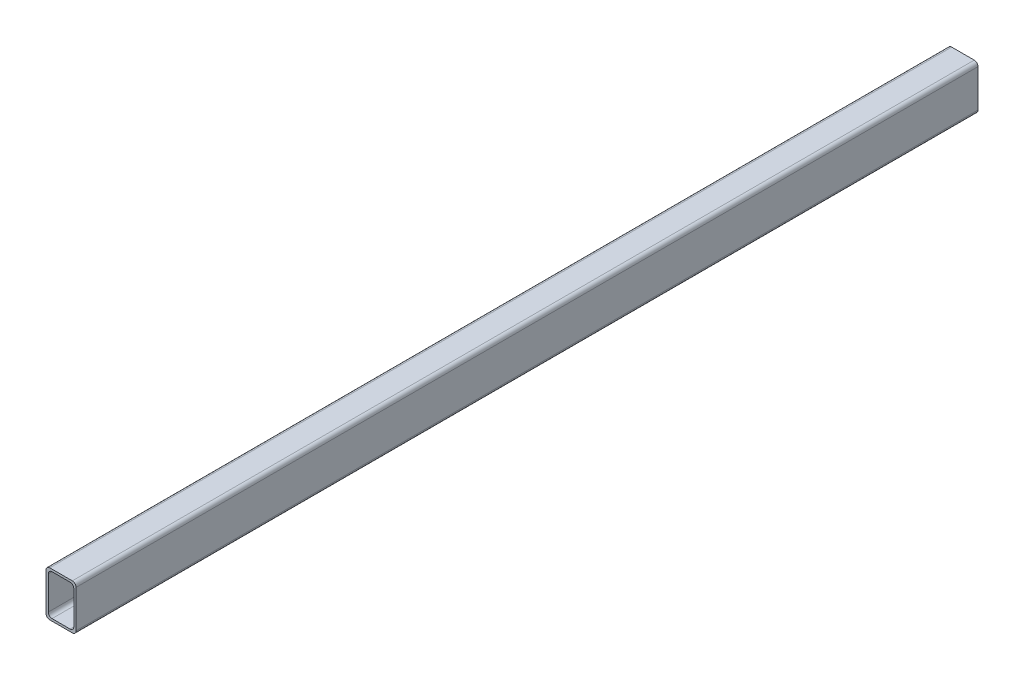
ISO-10303-21;
HEADER;
FILE_DESCRIPTION(('STEP AP214'),'2;1');
FILE_NAME('part.step','',(''),(''),'','','');
FILE_SCHEMA(('AUTOMOTIVE_DESIGN { 1 0 10303 214 1 1 1 1 }'));
ENDSEC;
DATA;
#1=APPLICATION_CONTEXT('core data for automotive mechanical design processes');
#2=APPLICATION_PROTOCOL_DEFINITION('international standard','automotive_design',2000,#1);
#3=PRODUCT_CONTEXT('',#1,'mechanical');
#4=PRODUCT('Part','Part','',(#3));
#5=PRODUCT_RELATED_PRODUCT_CATEGORY('part','',(#4));
#6=PRODUCT_DEFINITION_FORMATION('','',#4);
#7=PRODUCT_DEFINITION_CONTEXT('part definition',#1,'design');
#8=PRODUCT_DEFINITION('design','',#6,#7);
#9=PRODUCT_DEFINITION_SHAPE('','',#8);
#10=(LENGTH_UNIT() NAMED_UNIT(*) SI_UNIT(.MILLI.,.METRE.));
#11=(NAMED_UNIT(*) PLANE_ANGLE_UNIT() SI_UNIT($,.RADIAN.));
#12=(NAMED_UNIT(*) SI_UNIT($,.STERADIAN.) SOLID_ANGLE_UNIT());
#13=UNCERTAINTY_MEASURE_WITH_UNIT(LENGTH_MEASURE(1.E-05),#10,'distance_accuracy_value','');
#14=(GEOMETRIC_REPRESENTATION_CONTEXT(3) GLOBAL_UNCERTAINTY_ASSIGNED_CONTEXT((#13)) GLOBAL_UNIT_ASSIGNED_CONTEXT((#10,
#11,#12)) REPRESENTATION_CONTEXT('',''));
#15=CARTESIAN_POINT('',(0.,0.,0.));
#16=DIRECTION('',(0.,0.,1.));
#17=DIRECTION('',(1.,0.,0.));
#18=AXIS2_PLACEMENT_3D('',#15,#16,#17);
#19=CARTESIAN_POINT('',(-15.,-25.,1200.));
#20=DIRECTION('',(0.,0.,-1.));
#21=DIRECTION('',(-1.,0.,0.));
#22=AXIS2_PLACEMENT_3D('',#19,#20,#21);
#23=PLANE('',#22);
#24=CARTESIAN_POINT('',(-15.,-25.,1200.));
#25=DIRECTION('',(0.,0.,1.));
#26=DIRECTION('',(-1.,0.,0.));
#27=AXIS2_PLACEMENT_3D('',#24,#25,#26);
#28=CIRCLE('',#27,5.);
#29=CARTESIAN_POINT('',(-20.,-25.,1200.));
#30=VERTEX_POINT('',#29);
#31=CARTESIAN_POINT('',(-15.,-30.,1200.));
#32=VERTEX_POINT('',#31);
#33=EDGE_CURVE('E242',#30,#32,#28,.T.);
#34=ORIENTED_EDGE('',*,*,#33,.T.);
#35=DIRECTION('',(1.,0.,0.));
#36=VECTOR('',#35,1.);
#37=CARTESIAN_POINT('',(-15.,-30.,1200.));
#38=LINE('',#37,#36);
#39=CARTESIAN_POINT('',(15.,-30.,1200.));
#40=VERTEX_POINT('',#39);
#41=EDGE_CURVE('E246',#32,#40,#38,.T.);
#42=ORIENTED_EDGE('',*,*,#41,.T.);
#43=CARTESIAN_POINT('',(15.,-25.,1200.));
#44=DIRECTION('',(0.,0.,1.));
#45=DIRECTION('',(1.,0.,0.));
#46=AXIS2_PLACEMENT_3D('',#43,#44,#45);
#47=CIRCLE('',#46,5.);
#48=CARTESIAN_POINT('',(20.,-25.,1200.));
#49=VERTEX_POINT('',#48);
#50=EDGE_CURVE('E250',#40,#49,#47,.T.);
#51=ORIENTED_EDGE('',*,*,#50,.T.);
#52=DIRECTION('',(0.,1.,0.));
#53=VECTOR('',#52,1.);
#54=CARTESIAN_POINT('',(20.,-25.,1200.));
#55=LINE('',#54,#53);
#56=CARTESIAN_POINT('',(20.,25.,1200.));
#57=VERTEX_POINT('',#56);
#58=EDGE_CURVE('E253',#49,#57,#55,.T.);
#59=ORIENTED_EDGE('',*,*,#58,.T.);
#60=CARTESIAN_POINT('',(15.,25.,1200.));
#61=DIRECTION('',(0.,0.,1.));
#62=DIRECTION('',(-1.,0.,0.));
#63=AXIS2_PLACEMENT_3D('',#60,#61,#62);
#64=CIRCLE('',#63,5.);
#65=CARTESIAN_POINT('',(15.,30.,1200.));
#66=VERTEX_POINT('',#65);
#67=EDGE_CURVE('E256',#57,#66,#64,.T.);
#68=ORIENTED_EDGE('',*,*,#67,.T.);
#69=DIRECTION('',(-1.,0.,0.));
#70=VECTOR('',#69,1.);
#71=CARTESIAN_POINT('',(-15.,30.,1200.));
#72=LINE('',#71,#70);
#73=CARTESIAN_POINT('',(-15.,30.,1200.));
#74=VERTEX_POINT('',#73);
#75=EDGE_CURVE('E259',#66,#74,#72,.T.);
#76=ORIENTED_EDGE('',*,*,#75,.T.);
#77=CARTESIAN_POINT('',(-15.,25.,1200.));
#78=DIRECTION('',(0.,0.,1.));
#79=DIRECTION('',(-1.,0.,0.));
#80=AXIS2_PLACEMENT_3D('',#77,#78,#79);
#81=CIRCLE('',#80,5.);
#82=CARTESIAN_POINT('',(-20.,25.,1200.));
#83=VERTEX_POINT('',#82);
#84=EDGE_CURVE('E262',#74,#83,#81,.T.);
#85=ORIENTED_EDGE('',*,*,#84,.T.);
#86=DIRECTION('',(0.,-1.,0.));
#87=VECTOR('',#86,1.);
#88=CARTESIAN_POINT('',(-20.,-25.,1200.));
#89=LINE('',#88,#87);
#90=EDGE_CURVE('E265',#83,#30,#89,.T.);
#91=ORIENTED_EDGE('',*,*,#90,.T.);
#92=EDGE_LOOP('',(#34,#42,#51,#59,#68,#76,#85,#91));
#93=FACE_BOUND('',#92,.T.);
#94=CARTESIAN_POINT('',(12.,22.,1200.));
#95=DIRECTION('',(0.,0.,1.));
#96=DIRECTION('',(-1.,0.,0.));
#97=AXIS2_PLACEMENT_3D('',#94,#95,#96);
#98=CIRCLE('',#97,5.);
#99=CARTESIAN_POINT('',(17.,22.,1200.));
#100=VERTEX_POINT('',#99);
#101=CARTESIAN_POINT('',(12.,27.,1200.));
#102=VERTEX_POINT('',#101);
#103=EDGE_CURVE('E153',#100,#102,#98,.T.);
#104=ORIENTED_EDGE('',*,*,#103,.F.);
#105=DIRECTION('',(0.,1.,0.));
#106=VECTOR('',#105,1.);
#107=CARTESIAN_POINT('',(17.,-22.,1200.));
#108=LINE('',#107,#106);
#109=CARTESIAN_POINT('',(17.,-22.,1200.));
#110=VERTEX_POINT('',#109);
#111=EDGE_CURVE('E194',#110,#100,#108,.T.);
#112=ORIENTED_EDGE('',*,*,#111,.F.);
#113=CARTESIAN_POINT('',(12.,-22.,1200.));
#114=DIRECTION('',(0.,0.,1.));
#115=DIRECTION('',(1.,0.,0.));
#116=AXIS2_PLACEMENT_3D('',#113,#114,#115);
#117=CIRCLE('',#116,5.);
#118=CARTESIAN_POINT('',(12.,-27.,1200.));
#119=VERTEX_POINT('',#118);
#120=EDGE_CURVE('E191',#119,#110,#117,.T.);
#121=ORIENTED_EDGE('',*,*,#120,.F.);
#122=DIRECTION('',(1.,0.,0.));
#123=VECTOR('',#122,1.);
#124=CARTESIAN_POINT('',(-12.,-27.,1200.));
#125=LINE('',#124,#123);
#126=CARTESIAN_POINT('',(-12.,-27.,1200.));
#127=VERTEX_POINT('',#126);
#128=EDGE_CURVE('E188',#127,#119,#125,.T.);
#129=ORIENTED_EDGE('',*,*,#128,.F.);
#130=CARTESIAN_POINT('',(-12.,-22.,1200.));
#131=DIRECTION('',(0.,0.,1.));
#132=DIRECTION('',(-1.,0.,0.));
#133=AXIS2_PLACEMENT_3D('',#130,#131,#132);
#134=CIRCLE('',#133,5.);
#135=CARTESIAN_POINT('',(-17.,-22.,1200.));
#136=VERTEX_POINT('',#135);
#137=EDGE_CURVE('E185',#136,#127,#134,.T.);
#138=ORIENTED_EDGE('',*,*,#137,.F.);
#139=DIRECTION('',(0.,-1.,0.));
#140=VECTOR('',#139,1.);
#141=CARTESIAN_POINT('',(-17.,-22.,1200.));
#142=LINE('',#141,#140);
#143=CARTESIAN_POINT('',(-17.,22.,1200.));
#144=VERTEX_POINT('',#143);
#145=EDGE_CURVE('E180',#144,#136,#142,.T.);
#146=ORIENTED_EDGE('',*,*,#145,.F.);
#147=CARTESIAN_POINT('',(-12.,22.,1200.));
#148=DIRECTION('',(0.,0.,1.));
#149=DIRECTION('',(-1.,0.,0.));
#150=AXIS2_PLACEMENT_3D('',#147,#148,#149);
#151=CIRCLE('',#150,5.);
#152=CARTESIAN_POINT('',(-12.,27.,1200.));
#153=VERTEX_POINT('',#152);
#154=EDGE_CURVE('E176',#153,#144,#151,.T.);
#155=ORIENTED_EDGE('',*,*,#154,.F.);
#156=DIRECTION('',(-1.,0.,0.));
#157=VECTOR('',#156,1.);
#158=CARTESIAN_POINT('',(-12.,27.,1200.));
#159=LINE('',#158,#157);
#160=EDGE_CURVE('E162',#102,#153,#159,.T.);
#161=ORIENTED_EDGE('',*,*,#160,.F.);
#162=EDGE_LOOP('',(#104,#112,#121,#129,#138,#146,#155,#161));
#163=FACE_BOUND('',#162,.T.);
#164=ADVANCED_FACE('F39',(#93,#163),#23,.F.);
#165=CARTESIAN_POINT('',(-15.,-25.,0.));
#166=DIRECTION('',(0.,0.,-1.));
#167=DIRECTION('',(-1.,0.,0.));
#168=AXIS2_PLACEMENT_3D('',#165,#166,#167);
#169=PLANE('',#168);
#170=CARTESIAN_POINT('',(-15.,-25.,0.));
#171=DIRECTION('',(0.,0.,1.));
#172=DIRECTION('',(-1.,0.,0.));
#173=AXIS2_PLACEMENT_3D('',#170,#171,#172);
#174=CIRCLE('',#173,5.);
#175=CARTESIAN_POINT('',(-20.,-25.,0.));
#176=VERTEX_POINT('',#175);
#177=CARTESIAN_POINT('',(-15.,-30.,0.));
#178=VERTEX_POINT('',#177);
#179=EDGE_CURVE('E171',#176,#178,#174,.T.);
#180=ORIENTED_EDGE('',*,*,#179,.F.);
#181=DIRECTION('',(0.,-1.,0.));
#182=VECTOR('',#181,1.);
#183=CARTESIAN_POINT('',(-20.,-25.,0.));
#184=LINE('',#183,#182);
#185=CARTESIAN_POINT('',(-20.,25.,0.));
#186=VERTEX_POINT('',#185);
#187=EDGE_CURVE('E247',#186,#176,#184,.T.);
#188=ORIENTED_EDGE('',*,*,#187,.F.);
#189=CARTESIAN_POINT('',(-15.,25.,0.));
#190=DIRECTION('',(0.,0.,1.));
#191=DIRECTION('',(-1.,0.,0.));
#192=AXIS2_PLACEMENT_3D('',#189,#190,#191);
#193=CIRCLE('',#192,5.);
#194=CARTESIAN_POINT('',(-15.,30.,0.));
#195=VERTEX_POINT('',#194);
#196=EDGE_CURVE('E287',#195,#186,#193,.T.);
#197=ORIENTED_EDGE('',*,*,#196,.F.);
#198=DIRECTION('',(-1.,0.,0.));
#199=VECTOR('',#198,1.);
#200=CARTESIAN_POINT('',(-15.,30.,0.));
#201=LINE('',#200,#199);
#202=CARTESIAN_POINT('',(15.,30.,0.));
#203=VERTEX_POINT('',#202);
#204=EDGE_CURVE('E284',#203,#195,#201,.T.);
#205=ORIENTED_EDGE('',*,*,#204,.F.);
#206=CARTESIAN_POINT('',(15.,25.,0.));
#207=DIRECTION('',(0.,0.,1.));
#208=DIRECTION('',(-1.,0.,0.));
#209=AXIS2_PLACEMENT_3D('',#206,#207,#208);
#210=CIRCLE('',#209,5.);
#211=CARTESIAN_POINT('',(20.,25.,0.));
#212=VERTEX_POINT('',#211);
#213=EDGE_CURVE('E281',#212,#203,#210,.T.);
#214=ORIENTED_EDGE('',*,*,#213,.F.);
#215=DIRECTION('',(0.,1.,0.));
#216=VECTOR('',#215,1.);
#217=CARTESIAN_POINT('',(20.,-25.,0.));
#218=LINE('',#217,#216);
#219=CARTESIAN_POINT('',(20.,-25.,0.));
#220=VERTEX_POINT('',#219);
#221=EDGE_CURVE('E278',#220,#212,#218,.T.);
#222=ORIENTED_EDGE('',*,*,#221,.F.);
#223=CARTESIAN_POINT('',(15.,-25.,0.));
#224=DIRECTION('',(0.,0.,1.));
#225=DIRECTION('',(1.,0.,0.));
#226=AXIS2_PLACEMENT_3D('',#223,#224,#225);
#227=CIRCLE('',#226,5.);
#228=CARTESIAN_POINT('',(15.,-30.,0.));
#229=VERTEX_POINT('',#228);
#230=EDGE_CURVE('E275',#229,#220,#227,.T.);
#231=ORIENTED_EDGE('',*,*,#230,.F.);
#232=DIRECTION('',(1.,0.,0.));
#233=VECTOR('',#232,1.);
#234=CARTESIAN_POINT('',(-15.,-30.,0.));
#235=LINE('',#234,#233);
#236=EDGE_CURVE('E272',#178,#229,#235,.T.);
#237=ORIENTED_EDGE('',*,*,#236,.F.);
#238=EDGE_LOOP('',(#180,#188,#197,#205,#214,#222,#231,#237));
#239=FACE_BOUND('',#238,.T.);
#240=DIRECTION('',(0.,1.,0.));
#241=VECTOR('',#240,1.);
#242=CARTESIAN_POINT('',(17.,-22.,0.));
#243=LINE('',#242,#241);
#244=CARTESIAN_POINT('',(17.,-22.,0.));
#245=VERTEX_POINT('',#244);
#246=CARTESIAN_POINT('',(17.,22.,0.));
#247=VERTEX_POINT('',#246);
#248=EDGE_CURVE('E163',#245,#247,#243,.T.);
#249=ORIENTED_EDGE('',*,*,#248,.T.);
#250=CARTESIAN_POINT('',(12.,22.,0.));
#251=DIRECTION('',(0.,0.,1.));
#252=DIRECTION('',(-1.,0.,0.));
#253=AXIS2_PLACEMENT_3D('',#250,#251,#252);
#254=CIRCLE('',#253,5.);
#255=CARTESIAN_POINT('',(12.,27.,0.));
#256=VERTEX_POINT('',#255);
#257=EDGE_CURVE('E63',#247,#256,#254,.T.);
#258=ORIENTED_EDGE('',*,*,#257,.T.);
#259=DIRECTION('',(-1.,0.,0.));
#260=VECTOR('',#259,1.);
#261=CARTESIAN_POINT('',(-12.,27.,0.));
#262=LINE('',#261,#260);
#263=CARTESIAN_POINT('',(-12.,27.,0.));
#264=VERTEX_POINT('',#263);
#265=EDGE_CURVE('E169',#256,#264,#262,.T.);
#266=ORIENTED_EDGE('',*,*,#265,.T.);
#267=CARTESIAN_POINT('',(-12.,22.,0.));
#268=DIRECTION('',(0.,0.,1.));
#269=DIRECTION('',(-1.,0.,0.));
#270=AXIS2_PLACEMENT_3D('',#267,#268,#269);
#271=CIRCLE('',#270,5.);
#272=CARTESIAN_POINT('',(-17.,22.,0.));
#273=VERTEX_POINT('',#272);
#274=EDGE_CURVE('E201',#264,#273,#271,.T.);
#275=ORIENTED_EDGE('',*,*,#274,.T.);
#276=DIRECTION('',(0.,-1.,0.));
#277=VECTOR('',#276,1.);
#278=CARTESIAN_POINT('',(-17.,-22.,0.));
#279=LINE('',#278,#277);
#280=CARTESIAN_POINT('',(-17.,-22.,0.));
#281=VERTEX_POINT('',#280);
#282=EDGE_CURVE('E205',#273,#281,#279,.T.);
#283=ORIENTED_EDGE('',*,*,#282,.T.);
#284=CARTESIAN_POINT('',(-12.,-22.,0.));
#285=DIRECTION('',(0.,0.,1.));
#286=DIRECTION('',(-1.,0.,0.));
#287=AXIS2_PLACEMENT_3D('',#284,#285,#286);
#288=CIRCLE('',#287,5.);
#289=CARTESIAN_POINT('',(-12.,-27.,0.));
#290=VERTEX_POINT('',#289);
#291=EDGE_CURVE('E209',#281,#290,#288,.T.);
#292=ORIENTED_EDGE('',*,*,#291,.T.);
#293=DIRECTION('',(1.,0.,0.));
#294=VECTOR('',#293,1.);
#295=CARTESIAN_POINT('',(-12.,-27.,0.));
#296=LINE('',#295,#294);
#297=CARTESIAN_POINT('',(12.,-27.,0.));
#298=VERTEX_POINT('',#297);
#299=EDGE_CURVE('E213',#290,#298,#296,.T.);
#300=ORIENTED_EDGE('',*,*,#299,.T.);
#301=CARTESIAN_POINT('',(12.,-22.,0.));
#302=DIRECTION('',(0.,0.,1.));
#303=DIRECTION('',(1.,0.,0.));
#304=AXIS2_PLACEMENT_3D('',#301,#302,#303);
#305=CIRCLE('',#304,5.);
#306=EDGE_CURVE('E217',#298,#245,#305,.T.);
#307=ORIENTED_EDGE('',*,*,#306,.T.);
#308=EDGE_LOOP('',(#249,#258,#266,#275,#283,#292,#300,#307));
#309=FACE_BOUND('',#308,.T.);
#310=ADVANCED_FACE('F326',(#239,#309),#169,.T.);
#311=CARTESIAN_POINT('',(-15.,-25.,1200.));
#312=DIRECTION('',(0.,0.,-1.));
#313=DIRECTION('',(-1.,0.,0.));
#314=AXIS2_PLACEMENT_3D('',#311,#312,#313);
#315=CYLINDRICAL_SURFACE('',#314,5.);
#316=ORIENTED_EDGE('',*,*,#179,.T.);
#317=DIRECTION('',(0.,0.,-1.));
#318=VECTOR('',#317,1.);
#319=CARTESIAN_POINT('',(-15.,-30.,1200.));
#320=LINE('',#319,#318);
#321=EDGE_CURVE('E11',#32,#178,#320,.T.);
#322=ORIENTED_EDGE('',*,*,#321,.F.);
#323=ORIENTED_EDGE('',*,*,#33,.F.);
#324=DIRECTION('',(0.,0.,-1.));
#325=VECTOR('',#324,1.);
#326=CARTESIAN_POINT('',(-20.,-25.,1200.));
#327=LINE('',#326,#325);
#328=EDGE_CURVE('E268',#30,#176,#327,.T.);
#329=ORIENTED_EDGE('',*,*,#328,.T.);
#330=EDGE_LOOP('',(#316,#322,#323,#329));
#331=FACE_BOUND('',#330,.T.);
#332=ADVANCED_FACE('F41',(#331),#315,.T.);
#333=CARTESIAN_POINT('',(-15.,-30.,1200.));
#334=DIRECTION('',(0.,1.,0.));
#335=DIRECTION('',(0.,0.,1.));
#336=AXIS2_PLACEMENT_3D('',#333,#334,#335);
#337=PLANE('',#336);
#338=ORIENTED_EDGE('',*,*,#236,.T.);
#339=DIRECTION('',(0.,0.,-1.));
#340=VECTOR('',#339,1.);
#341=CARTESIAN_POINT('',(15.,-30.,1200.));
#342=LINE('',#341,#340);
#343=EDGE_CURVE('E48',#40,#229,#342,.T.);
#344=ORIENTED_EDGE('',*,*,#343,.F.);
#345=ORIENTED_EDGE('',*,*,#41,.F.);
#346=ORIENTED_EDGE('',*,*,#321,.T.);
#347=EDGE_LOOP('',(#338,#344,#345,#346));
#348=FACE_BOUND('',#347,.T.);
#349=ADVANCED_FACE('F343',(#348),#337,.F.);
#350=CARTESIAN_POINT('',(15.,-25.,1200.));
#351=DIRECTION('',(0.,0.,-1.));
#352=DIRECTION('',(-1.,0.,0.));
#353=AXIS2_PLACEMENT_3D('',#350,#351,#352);
#354=CYLINDRICAL_SURFACE('',#353,5.);
#355=ORIENTED_EDGE('',*,*,#230,.T.);
#356=DIRECTION('',(0.,0.,-1.));
#357=VECTOR('',#356,1.);
#358=CARTESIAN_POINT('',(20.,-25.,1200.));
#359=LINE('',#358,#357);
#360=EDGE_CURVE('E311',#49,#220,#359,.T.);
#361=ORIENTED_EDGE('',*,*,#360,.F.);
#362=ORIENTED_EDGE('',*,*,#50,.F.);
#363=ORIENTED_EDGE('',*,*,#343,.T.);
#364=EDGE_LOOP('',(#355,#361,#362,#363));
#365=FACE_BOUND('',#364,.T.);
#366=ADVANCED_FACE('F320',(#365),#354,.T.);
#367=CARTESIAN_POINT('',(20.,-25.,1200.));
#368=DIRECTION('',(-1.,0.,0.));
#369=DIRECTION('',(0.,0.,1.));
#370=AXIS2_PLACEMENT_3D('',#367,#368,#369);
#371=PLANE('',#370);
#372=ORIENTED_EDGE('',*,*,#221,.T.);
#373=DIRECTION('',(0.,0.,-1.));
#374=VECTOR('',#373,1.);
#375=CARTESIAN_POINT('',(20.,25.,1200.));
#376=LINE('',#375,#374);
#377=EDGE_CURVE('E307',#57,#212,#376,.T.);
#378=ORIENTED_EDGE('',*,*,#377,.F.);
#379=ORIENTED_EDGE('',*,*,#58,.F.);
#380=ORIENTED_EDGE('',*,*,#360,.T.);
#381=EDGE_LOOP('',(#372,#378,#379,#380));
#382=FACE_BOUND('',#381,.T.);
#383=ADVANCED_FACE('F332',(#382),#371,.F.);
#384=CARTESIAN_POINT('',(15.,25.,1200.));
#385=DIRECTION('',(0.,0.,-1.));
#386=DIRECTION('',(-1.,0.,0.));
#387=AXIS2_PLACEMENT_3D('',#384,#385,#386);
#388=CYLINDRICAL_SURFACE('',#387,5.);
#389=ORIENTED_EDGE('',*,*,#213,.T.);
#390=DIRECTION('',(0.,0.,-1.));
#391=VECTOR('',#390,1.);
#392=CARTESIAN_POINT('',(15.,30.,1200.));
#393=LINE('',#392,#391);
#394=EDGE_CURVE('E303',#66,#203,#393,.T.);
#395=ORIENTED_EDGE('',*,*,#394,.F.);
#396=ORIENTED_EDGE('',*,*,#67,.F.);
#397=ORIENTED_EDGE('',*,*,#377,.T.);
#398=EDGE_LOOP('',(#389,#395,#396,#397));
#399=FACE_BOUND('',#398,.T.);
#400=ADVANCED_FACE('F336',(#399),#388,.T.);
#401=CARTESIAN_POINT('',(-15.,30.,1200.));
#402=DIRECTION('',(0.,-1.,0.));
#403=DIRECTION('',(0.,0.,-1.));
#404=AXIS2_PLACEMENT_3D('',#401,#402,#403);
#405=PLANE('',#404);
#406=ORIENTED_EDGE('',*,*,#204,.T.);
#407=DIRECTION('',(0.,0.,-1.));
#408=VECTOR('',#407,1.);
#409=CARTESIAN_POINT('',(-15.,30.,1200.));
#410=LINE('',#409,#408);
#411=EDGE_CURVE('E299',#74,#195,#410,.T.);
#412=ORIENTED_EDGE('',*,*,#411,.F.);
#413=ORIENTED_EDGE('',*,*,#75,.F.);
#414=ORIENTED_EDGE('',*,*,#394,.T.);
#415=EDGE_LOOP('',(#406,#412,#413,#414));
#416=FACE_BOUND('',#415,.T.);
#417=ADVANCED_FACE('F356',(#416),#405,.F.);
#418=CARTESIAN_POINT('',(-15.,25.,1200.));
#419=DIRECTION('',(0.,0.,-1.));
#420=DIRECTION('',(-1.,0.,0.));
#421=AXIS2_PLACEMENT_3D('',#418,#419,#420);
#422=CYLINDRICAL_SURFACE('',#421,5.);
#423=ORIENTED_EDGE('',*,*,#196,.T.);
#424=DIRECTION('',(0.,0.,-1.));
#425=VECTOR('',#424,1.);
#426=CARTESIAN_POINT('',(-20.,25.,1200.));
#427=LINE('',#426,#425);
#428=EDGE_CURVE('E295',#83,#186,#427,.T.);
#429=ORIENTED_EDGE('',*,*,#428,.F.);
#430=ORIENTED_EDGE('',*,*,#84,.F.);
#431=ORIENTED_EDGE('',*,*,#411,.T.);
#432=EDGE_LOOP('',(#423,#429,#430,#431));
#433=FACE_BOUND('',#432,.T.);
#434=ADVANCED_FACE('F354',(#433),#422,.T.);
#435=CARTESIAN_POINT('',(-20.,-25.,1200.));
#436=DIRECTION('',(1.,0.,0.));
#437=DIRECTION('',(0.,0.,-1.));
#438=AXIS2_PLACEMENT_3D('',#435,#436,#437);
#439=PLANE('',#438);
#440=ORIENTED_EDGE('',*,*,#187,.T.);
#441=ORIENTED_EDGE('',*,*,#328,.F.);
#442=ORIENTED_EDGE('',*,*,#90,.F.);
#443=ORIENTED_EDGE('',*,*,#428,.T.);
#444=EDGE_LOOP('',(#440,#441,#442,#443));
#445=FACE_BOUND('',#444,.T.);
#446=ADVANCED_FACE('F349',(#445),#439,.F.);
#447=CARTESIAN_POINT('',(12.,22.,1200.));
#448=DIRECTION('',(0.,0.,-1.));
#449=DIRECTION('',(-1.,0.,0.));
#450=AXIS2_PLACEMENT_3D('',#447,#448,#449);
#451=CYLINDRICAL_SURFACE('',#450,5.);
#452=ORIENTED_EDGE('',*,*,#257,.F.);
#453=DIRECTION('',(0.,0.,-1.));
#454=VECTOR('',#453,1.);
#455=CARTESIAN_POINT('',(17.,22.,1200.));
#456=LINE('',#455,#454);
#457=EDGE_CURVE('E157',#100,#247,#456,.T.);
#458=ORIENTED_EDGE('',*,*,#457,.F.);
#459=ORIENTED_EDGE('',*,*,#103,.T.);
#460=DIRECTION('',(0.,0.,-1.));
#461=VECTOR('',#460,1.);
#462=CARTESIAN_POINT('',(12.,27.,1200.));
#463=LINE('',#462,#461);
#464=EDGE_CURVE('E156',#102,#256,#463,.T.);
#465=ORIENTED_EDGE('',*,*,#464,.T.);
#466=EDGE_LOOP('',(#452,#458,#459,#465));
#467=FACE_BOUND('',#466,.T.);
#468=ADVANCED_FACE('F155',(#467),#451,.F.);
#469=CARTESIAN_POINT('',(-12.,27.,1200.));
#470=DIRECTION('',(0.,-1.,0.));
#471=DIRECTION('',(0.,0.,-1.));
#472=AXIS2_PLACEMENT_3D('',#469,#470,#471);
#473=PLANE('',#472);
#474=ORIENTED_EDGE('',*,*,#265,.F.);
#475=ORIENTED_EDGE('',*,*,#464,.F.);
#476=ORIENTED_EDGE('',*,*,#160,.T.);
#477=DIRECTION('',(0.,0.,-1.));
#478=VECTOR('',#477,1.);
#479=CARTESIAN_POINT('',(-12.,27.,1200.));
#480=LINE('',#479,#478);
#481=EDGE_CURVE('E172',#153,#264,#480,.T.);
#482=ORIENTED_EDGE('',*,*,#481,.T.);
#483=EDGE_LOOP('',(#474,#475,#476,#482));
#484=FACE_BOUND('',#483,.T.);
#485=ADVANCED_FACE('F166',(#484),#473,.T.);
#486=CARTESIAN_POINT('',(-12.,22.,1200.));
#487=DIRECTION('',(0.,0.,-1.));
#488=DIRECTION('',(-1.,0.,0.));
#489=AXIS2_PLACEMENT_3D('',#486,#487,#488);
#490=CYLINDRICAL_SURFACE('',#489,5.);
#491=ORIENTED_EDGE('',*,*,#274,.F.);
#492=ORIENTED_EDGE('',*,*,#481,.F.);
#493=ORIENTED_EDGE('',*,*,#154,.T.);
#494=DIRECTION('',(0.,0.,-1.));
#495=VECTOR('',#494,1.);
#496=CARTESIAN_POINT('',(-17.,22.,1200.));
#497=LINE('',#496,#495);
#498=EDGE_CURVE('E237',#144,#273,#497,.T.);
#499=ORIENTED_EDGE('',*,*,#498,.T.);
#500=EDGE_LOOP('',(#491,#492,#493,#499));
#501=FACE_BOUND('',#500,.T.);
#502=ADVANCED_FACE('F381',(#501),#490,.F.);
#503=CARTESIAN_POINT('',(-17.,-22.,1200.));
#504=DIRECTION('',(1.,0.,0.));
#505=DIRECTION('',(0.,0.,-1.));
#506=AXIS2_PLACEMENT_3D('',#503,#504,#505);
#507=PLANE('',#506);
#508=ORIENTED_EDGE('',*,*,#282,.F.);
#509=ORIENTED_EDGE('',*,*,#498,.F.);
#510=ORIENTED_EDGE('',*,*,#145,.T.);
#511=DIRECTION('',(0.,0.,-1.));
#512=VECTOR('',#511,1.);
#513=CARTESIAN_POINT('',(-17.,-22.,1200.));
#514=LINE('',#513,#512);
#515=EDGE_CURVE('E234',#136,#281,#514,.T.);
#516=ORIENTED_EDGE('',*,*,#515,.T.);
#517=EDGE_LOOP('',(#508,#509,#510,#516));
#518=FACE_BOUND('',#517,.T.);
#519=ADVANCED_FACE('F385',(#518),#507,.T.);
#520=CARTESIAN_POINT('',(-12.,-22.,1200.));
#521=DIRECTION('',(0.,0.,-1.));
#522=DIRECTION('',(-1.,0.,0.));
#523=AXIS2_PLACEMENT_3D('',#520,#521,#522);
#524=CYLINDRICAL_SURFACE('',#523,5.);
#525=ORIENTED_EDGE('',*,*,#291,.F.);
#526=ORIENTED_EDGE('',*,*,#515,.F.);
#527=ORIENTED_EDGE('',*,*,#137,.T.);
#528=DIRECTION('',(0.,0.,-1.));
#529=VECTOR('',#528,1.);
#530=CARTESIAN_POINT('',(-12.,-27.,1200.));
#531=LINE('',#530,#529);
#532=EDGE_CURVE('E231',#127,#290,#531,.T.);
#533=ORIENTED_EDGE('',*,*,#532,.T.);
#534=EDGE_LOOP('',(#525,#526,#527,#533));
#535=FACE_BOUND('',#534,.T.);
#536=ADVANCED_FACE('F391',(#535),#524,.F.);
#537=CARTESIAN_POINT('',(-12.,-27.,1200.));
#538=DIRECTION('',(0.,1.,0.));
#539=DIRECTION('',(0.,0.,1.));
#540=AXIS2_PLACEMENT_3D('',#537,#538,#539);
#541=PLANE('',#540);
#542=ORIENTED_EDGE('',*,*,#299,.F.);
#543=ORIENTED_EDGE('',*,*,#532,.F.);
#544=ORIENTED_EDGE('',*,*,#128,.T.);
#545=DIRECTION('',(0.,0.,-1.));
#546=VECTOR('',#545,1.);
#547=CARTESIAN_POINT('',(12.,-27.,1200.));
#548=LINE('',#547,#546);
#549=EDGE_CURVE('E228',#119,#298,#548,.T.);
#550=ORIENTED_EDGE('',*,*,#549,.T.);
#551=EDGE_LOOP('',(#542,#543,#544,#550));
#552=FACE_BOUND('',#551,.T.);
#553=ADVANCED_FACE('F395',(#552),#541,.T.);
#554=CARTESIAN_POINT('',(12.,-22.,1200.));
#555=DIRECTION('',(0.,0.,-1.));
#556=DIRECTION('',(-1.,0.,0.));
#557=AXIS2_PLACEMENT_3D('',#554,#555,#556);
#558=CYLINDRICAL_SURFACE('',#557,5.);
#559=ORIENTED_EDGE('',*,*,#306,.F.);
#560=ORIENTED_EDGE('',*,*,#549,.F.);
#561=ORIENTED_EDGE('',*,*,#120,.T.);
#562=DIRECTION('',(0.,0.,-1.));
#563=VECTOR('',#562,1.);
#564=CARTESIAN_POINT('',(17.,-22.,1200.));
#565=LINE('',#564,#563);
#566=EDGE_CURVE('E55',#110,#245,#565,.T.);
#567=ORIENTED_EDGE('',*,*,#566,.T.);
#568=EDGE_LOOP('',(#559,#560,#561,#567));
#569=FACE_BOUND('',#568,.T.);
#570=ADVANCED_FACE('F399',(#569),#558,.F.);
#571=CARTESIAN_POINT('',(17.,-22.,1200.));
#572=DIRECTION('',(-1.,0.,0.));
#573=DIRECTION('',(0.,0.,1.));
#574=AXIS2_PLACEMENT_3D('',#571,#572,#573);
#575=PLANE('',#574);
#576=ORIENTED_EDGE('',*,*,#248,.F.);
#577=ORIENTED_EDGE('',*,*,#566,.F.);
#578=ORIENTED_EDGE('',*,*,#111,.T.);
#579=ORIENTED_EDGE('',*,*,#457,.T.);
#580=EDGE_LOOP('',(#576,#577,#578,#579));
#581=FACE_BOUND('',#580,.T.);
#582=ADVANCED_FACE('F403',(#581),#575,.T.);
#583=CLOSED_SHELL('',(#164,#310,#332,#349,#366,#383,#400,#417,#434,#446,#468,#485,#502,#519,
#536,#553,#570,#582));
#584=MANIFOLD_SOLID_BREP('B2',#583);
#585=ADVANCED_BREP_SHAPE_REPRESENTATION('',(#18,#584),#14);
#586=SHAPE_DEFINITION_REPRESENTATION(#9,#585);
ENDSEC;
END-ISO-10303-21;
